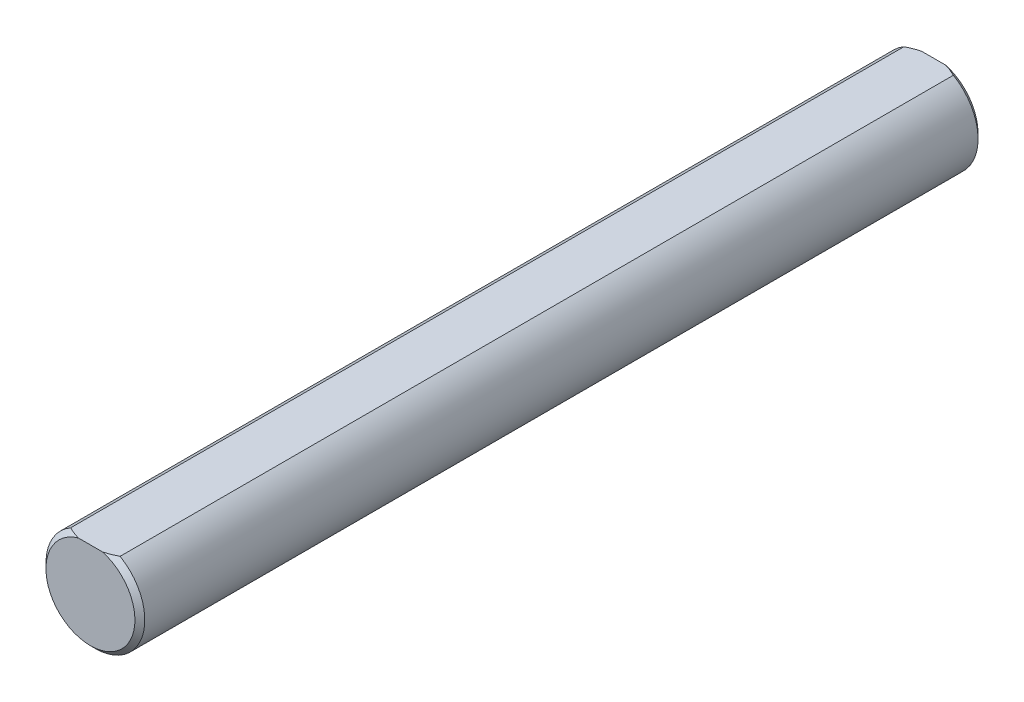
ISO-10303-21;
HEADER;
FILE_DESCRIPTION(('STEP AP214'),'2;1');
FILE_NAME('part.step','',(''),(''),'','','');
FILE_SCHEMA(('AUTOMOTIVE_DESIGN { 1 0 10303 214 1 1 1 1 }'));
ENDSEC;
DATA;
#1=APPLICATION_CONTEXT('core data for automotive mechanical design processes');
#2=APPLICATION_PROTOCOL_DEFINITION('international standard','automotive_design',2000,#1);
#3=PRODUCT_CONTEXT('',#1,'mechanical');
#4=PRODUCT('Part','Part','',(#3));
#5=PRODUCT_RELATED_PRODUCT_CATEGORY('part','',(#4));
#6=PRODUCT_DEFINITION_FORMATION('','',#4);
#7=PRODUCT_DEFINITION_CONTEXT('part definition',#1,'design');
#8=PRODUCT_DEFINITION('design','',#6,#7);
#9=PRODUCT_DEFINITION_SHAPE('','',#8);
#10=(LENGTH_UNIT() NAMED_UNIT(*) SI_UNIT(.MILLI.,.METRE.));
#11=(NAMED_UNIT(*) PLANE_ANGLE_UNIT() SI_UNIT($,.RADIAN.));
#12=(NAMED_UNIT(*) SI_UNIT($,.STERADIAN.) SOLID_ANGLE_UNIT());
#13=UNCERTAINTY_MEASURE_WITH_UNIT(LENGTH_MEASURE(1.E-05),#10,'distance_accuracy_value','');
#14=(GEOMETRIC_REPRESENTATION_CONTEXT(3) GLOBAL_UNCERTAINTY_ASSIGNED_CONTEXT((#13)) GLOBAL_UNIT_ASSIGNED_CONTEXT((#10,
#11,#12)) REPRESENTATION_CONTEXT('',''));
#15=CARTESIAN_POINT('',(0.,0.,0.));
#16=DIRECTION('',(0.,0.,1.));
#17=DIRECTION('',(1.,0.,0.));
#18=AXIS2_PLACEMENT_3D('',#15,#16,#17);
#19=CARTESIAN_POINT('',(0.,0.,27.079999988));
#20=DIRECTION('',(0.,0.,-1.));
#21=DIRECTION('',(-1.,0.,0.));
#22=AXIS2_PLACEMENT_3D('',#19,#20,#21);
#23=CYLINDRICAL_SURFACE('',#22,3.175);
#24=DIRECTION('',(0.,0.,1.));
#25=VECTOR('',#24,1.);
#26=CARTESIAN_POINT('',(-1.5875,2.74963065701559,-27.079999988));
#27=LINE('',#26,#25);
#28=CARTESIAN_POINT('',(-1.5875,2.74963065701559,-26.762499988));
#29=VERTEX_POINT('',#28);
#30=CARTESIAN_POINT('',(-1.5875,2.74963065701559,26.762499988));
#31=VERTEX_POINT('',#30);
#32=EDGE_CURVE('E88',#29,#31,#27,.T.);
#33=ORIENTED_EDGE('',*,*,#32,.F.);
#34=CARTESIAN_POINT('',(0.,0.,-26.762499988));
#35=DIRECTION('',(0.,0.,1.));
#36=DIRECTION('',(1.,0.,0.));
#37=AXIS2_PLACEMENT_3D('',#34,#35,#36);
#38=CIRCLE('',#37,3.175);
#39=CARTESIAN_POINT('',(1.5875,2.74963065701559,-26.762499988));
#40=VERTEX_POINT('',#39);
#41=EDGE_CURVE('E99',#29,#40,#38,.T.);
#42=ORIENTED_EDGE('',*,*,#41,.T.);
#43=DIRECTION('',(0.,0.,1.));
#44=VECTOR('',#43,1.);
#45=CARTESIAN_POINT('',(1.5875,2.74963065701559,-27.079999988));
#46=LINE('',#45,#44);
#47=CARTESIAN_POINT('',(1.5875,2.74963065701559,26.762499988));
#48=VERTEX_POINT('',#47);
#49=EDGE_CURVE('E101',#40,#48,#46,.T.);
#50=ORIENTED_EDGE('',*,*,#49,.T.);
#51=CARTESIAN_POINT('',(0.,0.,26.762499988));
#52=DIRECTION('',(0.,0.,1.));
#53=DIRECTION('',(1.,0.,0.));
#54=AXIS2_PLACEMENT_3D('',#51,#52,#53);
#55=CIRCLE('',#54,3.175);
#56=EDGE_CURVE('E100',#48,#31,#55,.F.);
#57=ORIENTED_EDGE('',*,*,#56,.T.);
#58=EDGE_LOOP('',(#33,#42,#50,#57));
#59=FACE_BOUND('',#58,.T.);
#60=ADVANCED_FACE('F41',(#59),#23,.T.);
#61=CARTESIAN_POINT('',(0.,0.,27.079999988));
#62=DIRECTION('',(0.,0.,1.));
#63=DIRECTION('',(1.,0.,0.));
#64=AXIS2_PLACEMENT_3D('',#61,#62,#63);
#65=PLANE('',#64);
#66=DIRECTION('',(1.,0.,0.));
#67=VECTOR('',#66,1.);
#68=CARTESIAN_POINT('',(-1.5875,2.74963065701559,27.079999988));
#69=LINE('',#68,#67);
#70=CARTESIAN_POINT('',(-0.77771299333373,2.74963065701559,27.079999988));
#71=VERTEX_POINT('',#70);
#72=CARTESIAN_POINT('',(0.777712993333732,2.74963065701559,27.079999988));
#73=VERTEX_POINT('',#72);
#74=EDGE_CURVE('E146',#71,#73,#69,.T.);
#75=ORIENTED_EDGE('',*,*,#74,.F.);
#76=CARTESIAN_POINT('',(0.,0.,27.079999988));
#77=DIRECTION('',(0.,0.,1.));
#78=DIRECTION('',(1.,0.,0.));
#79=AXIS2_PLACEMENT_3D('',#76,#77,#78);
#80=CIRCLE('',#79,2.85750000000002);
#81=EDGE_CURVE('E11',#71,#73,#80,.T.);
#82=ORIENTED_EDGE('',*,*,#81,.T.);
#83=EDGE_LOOP('',(#75,#82));
#84=FACE_BOUND('',#83,.T.);
#85=ADVANCED_FACE('F139',(#84),#65,.T.);
#86=CARTESIAN_POINT('',(0.,0.,-27.079999988));
#87=DIRECTION('',(0.,0.,1.));
#88=DIRECTION('',(1.,0.,0.));
#89=AXIS2_PLACEMENT_3D('',#86,#87,#88);
#90=PLANE('',#89);
#91=DIRECTION('',(1.,0.,0.));
#92=VECTOR('',#91,1.);
#93=CARTESIAN_POINT('',(-1.5875,2.74963065701559,-27.079999988));
#94=LINE('',#93,#92);
#95=CARTESIAN_POINT('',(-0.777712993333552,2.74963065701559,-27.079999988));
#96=VERTEX_POINT('',#95);
#97=CARTESIAN_POINT('',(0.777712993333552,2.74963065701559,-27.079999988));
#98=VERTEX_POINT('',#97);
#99=EDGE_CURVE('E90',#96,#98,#94,.T.);
#100=ORIENTED_EDGE('',*,*,#99,.T.);
#101=CARTESIAN_POINT('',(0.,0.,-27.079999988));
#102=DIRECTION('',(0.,0.,1.));
#103=DIRECTION('',(1.,0.,0.));
#104=AXIS2_PLACEMENT_3D('',#101,#102,#103);
#105=CIRCLE('',#104,2.85749999999997);
#106=EDGE_CURVE('E50',#98,#96,#105,.F.);
#107=ORIENTED_EDGE('',*,*,#106,.T.);
#108=EDGE_LOOP('',(#100,#107));
#109=FACE_BOUND('',#108,.T.);
#110=ADVANCED_FACE('F120',(#109),#90,.F.);
#111=CARTESIAN_POINT('',(-1.5875,2.74963065701559,-27.079999988));
#112=DIRECTION('',(0.,-1.,0.));
#113=DIRECTION('',(0.,0.,-1.));
#114=AXIS2_PLACEMENT_3D('',#111,#112,#113);
#115=PLANE('',#114);
#116=ORIENTED_EDGE('',*,*,#49,.F.);
#117=CARTESIAN_POINT('',(1.5875,2.74963065701559,-26.762499988));
#118=CARTESIAN_POINT('',(1.52250516699269,2.74963065701559,-26.7949880704798));
#119=CARTESIAN_POINT('',(1.45690188238028,2.74963065701559,-26.8263018956193));
#120=CARTESIAN_POINT('',(1.32458227077019,2.74963065701559,-26.8860258394252));
#121=CARTESIAN_POINT('',(1.25786903887729,2.74963065701559,-26.9144428350168));
#122=CARTESIAN_POINT('',(1.12308918002492,2.74963065701559,-26.9679919937044));
#123=CARTESIAN_POINT('',(1.05502199036171,2.74963065701559,-26.9931227567341));
#124=CARTESIAN_POINT('',(0.9174222567879,2.74963065701559,-27.0395821839475));
#125=CARTESIAN_POINT('',(0.847886543275426,2.74963065701559,-27.0609014235307));
#126=CARTESIAN_POINT('',(0.777712993333552,2.74963065701559,-27.079999988));
#127=B_SPLINE_CURVE_WITH_KNOTS('',3,(#117,#118,#119,#120,#121,#122,#123,#124,#125,#126),
.UNSPECIFIED.,.F.,.F.,(4,2,2,2,4),(0.,0.218002568777807,0.435474929897206,0.653039643130625,
0.871135095680673),.UNSPECIFIED.);
#128=EDGE_CURVE('E94',#40,#98,#127,.T.);
#129=ORIENTED_EDGE('',*,*,#128,.T.);
#130=ORIENTED_EDGE('',*,*,#99,.F.);
#131=CARTESIAN_POINT('',(-0.777712993333552,2.74963065701559,-27.079999988));
#132=CARTESIAN_POINT('',(-0.847886543275426,2.74963065701559,-27.0609014235307));
#133=CARTESIAN_POINT('',(-0.9174222567879,2.74963065701559,-27.0395821839475));
#134=CARTESIAN_POINT('',(-1.05502199036171,2.74963065701559,-26.9931227567341));
#135=CARTESIAN_POINT('',(-1.12308918002492,2.74963065701559,-26.9679919937044));
#136=CARTESIAN_POINT('',(-1.25786903887729,2.74963065701559,-26.9144428350168));
#137=CARTESIAN_POINT('',(-1.32458227077019,2.74963065701559,-26.8860258394252));
#138=CARTESIAN_POINT('',(-1.45690188238028,2.74963065701559,-26.8263018956193));
#139=CARTESIAN_POINT('',(-1.52250516699269,2.74963065701559,-26.7949880704798));
#140=CARTESIAN_POINT('',(-1.5875,2.74963065701559,-26.762499988));
#141=B_SPLINE_CURVE_WITH_KNOTS('',3,(#131,#132,#133,#134,#135,#136,#137,#138,#139,#140),
.UNSPECIFIED.,.F.,.F.,(4,2,2,2,4),(0.,0.218095452550048,0.435660165783467,0.653132526902868,
0.871135095680674),.UNSPECIFIED.);
#142=EDGE_CURVE('E84',#96,#29,#141,.T.);
#143=ORIENTED_EDGE('',*,*,#142,.T.);
#144=ORIENTED_EDGE('',*,*,#32,.T.);
#145=CARTESIAN_POINT('',(-1.5875,2.74963065701559,26.762499988));
#146=CARTESIAN_POINT('',(-1.5225051669927,2.74963065701559,26.7949880704799));
#147=CARTESIAN_POINT('',(-1.4569018823803,2.74963065701559,26.8263018956194));
#148=CARTESIAN_POINT('',(-1.32458227077024,2.74963065701559,26.8860258394252));
#149=CARTESIAN_POINT('',(-1.25786903887736,2.74963065701559,26.9144428350169));
#150=CARTESIAN_POINT('',(-1.12308918002502,2.74963065701559,26.9679919937044));
#151=CARTESIAN_POINT('',(-1.05502199036182,2.74963065701559,26.9931227567341));
#152=CARTESIAN_POINT('',(-0.917422256788046,2.74963065701559,27.0395821839475));
#153=CARTESIAN_POINT('',(-0.847886543275588,2.74963065701559,27.0609014235307));
#154=CARTESIAN_POINT('',(-0.77771299333373,2.74963065701559,27.079999988));
#155=B_SPLINE_CURVE_WITH_KNOTS('',3,(#145,#146,#147,#148,#149,#150,#151,#152,#153,#154),
.UNSPECIFIED.,.F.,.F.,(4,2,2,2,4),(0.,0.218002568777759,0.435474929897113,0.653039643130485,
0.871135095680487),.UNSPECIFIED.);
#156=EDGE_CURVE('E64',#31,#71,#155,.T.);
#157=ORIENTED_EDGE('',*,*,#156,.T.);
#158=ORIENTED_EDGE('',*,*,#74,.T.);
#159=CARTESIAN_POINT('',(0.777712993333731,2.74963065701559,27.079999988));
#160=CARTESIAN_POINT('',(0.847886543275589,2.74963065701559,27.0609014235307));
#161=CARTESIAN_POINT('',(0.917422256788047,2.74963065701559,27.0395821839475));
#162=CARTESIAN_POINT('',(1.05502199036182,2.74963065701559,26.9931227567341));
#163=CARTESIAN_POINT('',(1.12308918002502,2.74963065701559,26.9679919937044));
#164=CARTESIAN_POINT('',(1.25786903887736,2.74963065701559,26.9144428350169));
#165=CARTESIAN_POINT('',(1.32458227077024,2.74963065701559,26.8860258394252));
#166=CARTESIAN_POINT('',(1.4569018823803,2.74963065701559,26.8263018956194));
#167=CARTESIAN_POINT('',(1.5225051669927,2.74963065701559,26.7949880704799));
#168=CARTESIAN_POINT('',(1.5875,2.74963065701559,26.762499988));
#169=B_SPLINE_CURVE_WITH_KNOTS('',3,(#159,#160,#161,#162,#163,#164,#165,#166,#167,#168),
.UNSPECIFIED.,.F.,.F.,(4,2,2,2,4),(0.,0.218095452550002,0.435660165783374,0.653132526902727,
0.871135095680487),.UNSPECIFIED.);
#170=EDGE_CURVE('E57',#73,#48,#169,.T.);
#171=ORIENTED_EDGE('',*,*,#170,.T.);
#172=EDGE_LOOP('',(#116,#129,#130,#143,#144,#157,#158,#171));
#173=FACE_BOUND('',#172,.T.);
#174=ADVANCED_FACE('F87',(#173),#115,.F.);
#175=CARTESIAN_POINT('',(0.,0.,-26.762499988));
#176=DIRECTION('',(0.,0.,1.));
#177=DIRECTION('',(1.,0.,0.));
#178=AXIS2_PLACEMENT_3D('',#175,#176,#177);
#179=CONICAL_SURFACE('',#178,3.175,0.785398163397442);
#180=ORIENTED_EDGE('',*,*,#142,.F.);
#181=ORIENTED_EDGE('',*,*,#106,.F.);
#182=ORIENTED_EDGE('',*,*,#128,.F.);
#183=ORIENTED_EDGE('',*,*,#41,.F.);
#184=EDGE_LOOP('',(#180,#181,#182,#183));
#185=FACE_BOUND('',#184,.T.);
#186=ADVANCED_FACE('F103',(#185),#179,.T.);
#187=CARTESIAN_POINT('',(0.,0.,27.079999988));
#188=DIRECTION('',(0.,0.,-1.));
#189=DIRECTION('',(-1.,0.,0.));
#190=AXIS2_PLACEMENT_3D('',#187,#188,#189);
#191=CONICAL_SURFACE('',#190,2.85750000000002,0.785398163397448);
#192=ORIENTED_EDGE('',*,*,#156,.F.);
#193=ORIENTED_EDGE('',*,*,#56,.F.);
#194=ORIENTED_EDGE('',*,*,#170,.F.);
#195=ORIENTED_EDGE('',*,*,#81,.F.);
#196=EDGE_LOOP('',(#192,#193,#194,#195));
#197=FACE_BOUND('',#196,.T.);
#198=ADVANCED_FACE('F43',(#197),#191,.T.);
#199=CLOSED_SHELL('',(#60,#85,#110,#174,#186,#198));
#200=MANIFOLD_SOLID_BREP('B2',#199);
#201=ADVANCED_BREP_SHAPE_REPRESENTATION('',(#18,#200),#14);
#202=SHAPE_DEFINITION_REPRESENTATION(#9,#201);
ENDSEC;
END-ISO-10303-21;
